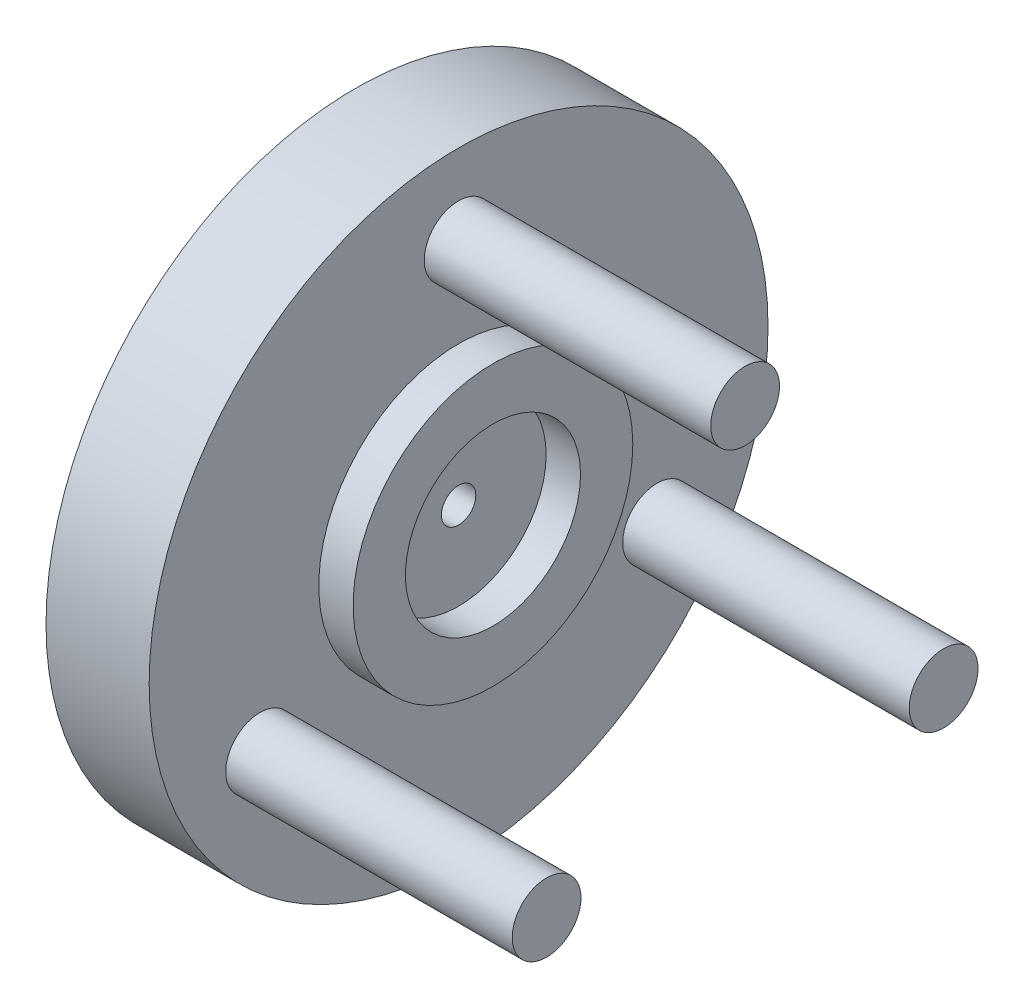
ISO-10303-21;
HEADER;
FILE_DESCRIPTION(('STEP AP214'),'2;1');
FILE_NAME('part.step','',(''),(''),'','','');
FILE_SCHEMA(('AUTOMOTIVE_DESIGN { 1 0 10303 214 1 1 1 1 }'));
ENDSEC;
DATA;
#1=APPLICATION_CONTEXT('core data for automotive mechanical design processes');
#2=APPLICATION_PROTOCOL_DEFINITION('international standard','automotive_design',2000,#1);
#3=PRODUCT_CONTEXT('',#1,'mechanical');
#4=PRODUCT('Part','Part','',(#3));
#5=PRODUCT_RELATED_PRODUCT_CATEGORY('part','',(#4));
#6=PRODUCT_DEFINITION_FORMATION('','',#4);
#7=PRODUCT_DEFINITION_CONTEXT('part definition',#1,'design');
#8=PRODUCT_DEFINITION('design','',#6,#7);
#9=PRODUCT_DEFINITION_SHAPE('','',#8);
#10=(LENGTH_UNIT() NAMED_UNIT(*) SI_UNIT(.MILLI.,.METRE.));
#11=(NAMED_UNIT(*) PLANE_ANGLE_UNIT() SI_UNIT($,.RADIAN.));
#12=(NAMED_UNIT(*) SI_UNIT($,.STERADIAN.) SOLID_ANGLE_UNIT());
#13=UNCERTAINTY_MEASURE_WITH_UNIT(LENGTH_MEASURE(1.E-05),#10,'distance_accuracy_value','');
#14=(GEOMETRIC_REPRESENTATION_CONTEXT(3) GLOBAL_UNCERTAINTY_ASSIGNED_CONTEXT((#13)) GLOBAL_UNIT_ASSIGNED_CONTEXT((#10,
#11,#12)) REPRESENTATION_CONTEXT('',''));
#15=CARTESIAN_POINT('',(0.,0.,0.));
#16=DIRECTION('',(0.,0.,1.));
#17=DIRECTION('',(1.,0.,0.));
#18=AXIS2_PLACEMENT_3D('',#15,#16,#17);
#19=CARTESIAN_POINT('',(9.,0.,0.));
#20=DIRECTION('',(1.,0.,0.));
#21=DIRECTION('',(0.,0.,-1.));
#22=AXIS2_PLACEMENT_3D('',#19,#20,#21);
#23=PLANE('',#22);
#24=CARTESIAN_POINT('',(9.,0.,0.));
#25=DIRECTION('',(1.,0.,0.));
#26=DIRECTION('',(0.,0.,-1.));
#27=AXIS2_PLACEMENT_3D('',#24,#25,#26);
#28=CIRCLE('',#27,1.5);
#29=CARTESIAN_POINT('',(9.,0.,-1.5));
#30=VERTEX_POINT('',#29);
#31=EDGE_CURVE('E61',#30,#30,#28,.T.);
#32=ORIENTED_EDGE('',*,*,#31,.F.);
#33=EDGE_LOOP('',(#32));
#34=FACE_BOUND('',#33,.T.);
#35=CARTESIAN_POINT('',(9.,0.,0.));
#36=DIRECTION('',(1.,0.,0.));
#37=DIRECTION('',(0.,0.,-1.));
#38=AXIS2_PLACEMENT_3D('',#35,#36,#37);
#39=CIRCLE('',#38,7.64);
#40=CARTESIAN_POINT('',(9.,0.,-7.64));
#41=VERTEX_POINT('',#40);
#42=EDGE_CURVE('E10',#41,#41,#39,.F.);
#43=ORIENTED_EDGE('',*,*,#42,.F.);
#44=EDGE_LOOP('',(#43));
#45=FACE_BOUND('',#44,.T.);
#46=ADVANCED_FACE('F41',(#34,#45),#23,.T.);
#47=CARTESIAN_POINT('',(4.,0.,0.));
#48=DIRECTION('',(-1.,0.,0.));
#49=DIRECTION('',(0.,0.,1.));
#50=AXIS2_PLACEMENT_3D('',#47,#48,#49);
#51=CYLINDRICAL_SURFACE('',#50,2.8);
#52=CARTESIAN_POINT('',(4.,0.,0.));
#53=DIRECTION('',(1.,0.,0.));
#54=DIRECTION('',(0.,0.,-1.));
#55=AXIS2_PLACEMENT_3D('',#52,#53,#54);
#56=CIRCLE('',#55,2.8);
#57=CARTESIAN_POINT('',(4.,0.,-2.8));
#58=VERTEX_POINT('',#57);
#59=EDGE_CURVE('E56',#58,#58,#56,.T.);
#60=ORIENTED_EDGE('',*,*,#59,.T.);
#61=EDGE_LOOP('',(#60));
#62=FACE_BOUND('',#61,.T.);
#63=CARTESIAN_POINT('',(0.,0.,0.));
#64=DIRECTION('',(1.,0.,0.));
#65=DIRECTION('',(0.,0.,-1.));
#66=AXIS2_PLACEMENT_3D('',#63,#64,#65);
#67=CIRCLE('',#66,2.8);
#68=CARTESIAN_POINT('',(0.,0.,-2.8));
#69=VERTEX_POINT('',#68);
#70=EDGE_CURVE('E52',#69,#69,#67,.T.);
#71=ORIENTED_EDGE('',*,*,#70,.F.);
#72=EDGE_LOOP('',(#71));
#73=FACE_BOUND('',#72,.T.);
#74=ADVANCED_FACE('F43',(#62,#73),#51,.F.);
#75=CARTESIAN_POINT('',(4.,0.,0.));
#76=DIRECTION('',(-1.,0.,0.));
#77=DIRECTION('',(0.,0.,1.));
#78=AXIS2_PLACEMENT_3D('',#75,#76,#77);
#79=CYLINDRICAL_SURFACE('',#78,27.);
#80=CARTESIAN_POINT('',(0.,0.,0.));
#81=DIRECTION('',(1.,0.,0.));
#82=DIRECTION('',(0.,0.,-1.));
#83=AXIS2_PLACEMENT_3D('',#80,#81,#82);
#84=CIRCLE('',#83,27.);
#85=CARTESIAN_POINT('',(0.,0.,-27.));
#86=VERTEX_POINT('',#85);
#87=EDGE_CURVE('E48',#86,#86,#84,.T.);
#88=ORIENTED_EDGE('',*,*,#87,.T.);
#89=EDGE_LOOP('',(#88));
#90=FACE_BOUND('',#89,.T.);
#91=CARTESIAN_POINT('',(9.,0.,0.));
#92=DIRECTION('',(1.,0.,0.));
#93=DIRECTION('',(0.,0.,-1.));
#94=AXIS2_PLACEMENT_3D('',#91,#92,#93);
#95=CIRCLE('',#94,27.);
#96=CARTESIAN_POINT('',(9.,0.,-27.));
#97=VERTEX_POINT('',#96);
#98=EDGE_CURVE('E65',#97,#97,#95,.T.);
#99=ORIENTED_EDGE('',*,*,#98,.F.);
#100=EDGE_LOOP('',(#99));
#101=FACE_BOUND('',#100,.T.);
#102=ADVANCED_FACE('F124',(#90,#101),#79,.T.);
#103=CARTESIAN_POINT('',(0.,0.,0.));
#104=DIRECTION('',(1.,0.,0.));
#105=DIRECTION('',(0.,0.,-1.));
#106=AXIS2_PLACEMENT_3D('',#103,#104,#105);
#107=PLANE('',#106);
#108=ORIENTED_EDGE('',*,*,#70,.T.);
#109=EDGE_LOOP('',(#108));
#110=FACE_BOUND('',#109,.T.);
#111=ORIENTED_EDGE('',*,*,#87,.F.);
#112=EDGE_LOOP('',(#111));
#113=FACE_BOUND('',#112,.T.);
#114=ADVANCED_FACE('F153',(#110,#113),#107,.F.);
#115=CARTESIAN_POINT('',(4.,0.,0.));
#116=DIRECTION('',(1.,0.,0.));
#117=DIRECTION('',(0.,0.,-1.));
#118=AXIS2_PLACEMENT_3D('',#115,#116,#117);
#119=PLANE('',#118);
#120=CARTESIAN_POINT('',(4.,0.,0.));
#121=DIRECTION('',(1.,0.,0.));
#122=DIRECTION('',(0.,0.,-1.));
#123=AXIS2_PLACEMENT_3D('',#120,#121,#122);
#124=CIRCLE('',#123,1.5);
#125=CARTESIAN_POINT('',(4.,0.,-1.5));
#126=VERTEX_POINT('',#125);
#127=EDGE_CURVE('E62',#126,#126,#124,.T.);
#128=ORIENTED_EDGE('',*,*,#127,.T.);
#129=EDGE_LOOP('',(#128));
#130=FACE_BOUND('',#129,.T.);
#131=ORIENTED_EDGE('',*,*,#59,.F.);
#132=EDGE_LOOP('',(#131));
#133=FACE_BOUND('',#132,.T.);
#134=ADVANCED_FACE('F139',(#130,#133),#119,.F.);
#135=CARTESIAN_POINT('',(9.,0.,0.));
#136=DIRECTION('',(-1.,0.,0.));
#137=DIRECTION('',(0.,0.,1.));
#138=AXIS2_PLACEMENT_3D('',#135,#136,#137);
#139=CYLINDRICAL_SURFACE('',#138,1.5);
#140=ORIENTED_EDGE('',*,*,#31,.T.);
#141=EDGE_LOOP('',(#140));
#142=FACE_BOUND('',#141,.T.);
#143=ORIENTED_EDGE('',*,*,#127,.F.);
#144=EDGE_LOOP('',(#143));
#145=FACE_BOUND('',#144,.T.);
#146=ADVANCED_FACE('F131',(#142,#145),#139,.F.);
#147=CARTESIAN_POINT('',(9.,0.,0.));
#148=DIRECTION('',(1.,0.,0.));
#149=DIRECTION('',(0.,0.,-1.));
#150=AXIS2_PLACEMENT_3D('',#147,#148,#149);
#151=CIRCLE('',#150,12.2);
#152=CARTESIAN_POINT('',(9.,0.,-12.2));
#153=VERTEX_POINT('',#152);
#154=EDGE_CURVE('E89',#153,#153,#151,.T.);
#155=ORIENTED_EDGE('',*,*,#154,.F.);
#156=EDGE_LOOP('',(#155));
#157=FACE_BOUND('',#156,.T.);
#158=CARTESIAN_POINT('',(9.,-9.99999999999984,17.3205080756889));
#159=DIRECTION('',(1.,0.,0.));
#160=DIRECTION('',(0.,0.,-1.));
#161=AXIS2_PLACEMENT_3D('',#158,#159,#160);
#162=CIRCLE('',#161,3.);
#163=CARTESIAN_POINT('',(9.,-9.99999999999984,14.3205080756889));
#164=VERTEX_POINT('',#163);
#165=EDGE_CURVE('E83',#164,#164,#162,.T.);
#166=ORIENTED_EDGE('',*,*,#165,.F.);
#167=EDGE_LOOP('',(#166));
#168=FACE_BOUND('',#167,.T.);
#169=CARTESIAN_POINT('',(9.,-10.0000000000009,-17.32050807569));
#170=DIRECTION('',(1.,0.,0.));
#171=DIRECTION('',(0.,0.,-1.));
#172=AXIS2_PLACEMENT_3D('',#169,#170,#171);
#173=CIRCLE('',#172,2.99999999999948);
#174=CARTESIAN_POINT('',(9.,-10.0000000000009,-20.3205080756894));
#175=VERTEX_POINT('',#174);
#176=EDGE_CURVE('E77',#175,#175,#173,.T.);
#177=ORIENTED_EDGE('',*,*,#176,.F.);
#178=EDGE_LOOP('',(#177));
#179=FACE_BOUND('',#178,.T.);
#180=CARTESIAN_POINT('',(9.,20.0000000000007,-1.46428559612947E-12));
#181=DIRECTION('',(1.,0.,0.));
#182=DIRECTION('',(0.,0.,-1.));
#183=AXIS2_PLACEMENT_3D('',#180,#181,#182);
#184=CIRCLE('',#183,2.99999999999839);
#185=CARTESIAN_POINT('',(9.,20.0000000000007,-2.99999999999985));
#186=VERTEX_POINT('',#185);
#187=EDGE_CURVE('E71',#186,#186,#184,.T.);
#188=ORIENTED_EDGE('',*,*,#187,.F.);
#189=EDGE_LOOP('',(#188));
#190=FACE_BOUND('',#189,.T.);
#191=ORIENTED_EDGE('',*,*,#98,.T.);
#192=EDGE_LOOP('',(#191));
#193=FACE_BOUND('',#192,.T.);
#194=ADVANCED_FACE('F120',(#157,#168,#179,#190,#193),#23,.T.);
#195=CARTESIAN_POINT('',(34.,20.0000000000007,-1.46428559612947E-12));
#196=DIRECTION('',(-1.,0.,0.));
#197=DIRECTION('',(0.,0.,1.));
#198=AXIS2_PLACEMENT_3D('',#195,#196,#197);
#199=CYLINDRICAL_SURFACE('',#198,2.99999999999839);
#200=CARTESIAN_POINT('',(34.,20.0000000000007,-1.46428559612947E-12));
#201=DIRECTION('',(1.,0.,0.));
#202=DIRECTION('',(0.,0.,-1.));
#203=AXIS2_PLACEMENT_3D('',#200,#201,#202);
#204=CIRCLE('',#203,2.99999999999839);
#205=CARTESIAN_POINT('',(34.,20.0000000000007,-2.99999999999985));
#206=VERTEX_POINT('',#205);
#207=EDGE_CURVE('E66',#206,#206,#204,.T.);
#208=ORIENTED_EDGE('',*,*,#207,.F.);
#209=EDGE_LOOP('',(#208));
#210=FACE_BOUND('',#209,.T.);
#211=ORIENTED_EDGE('',*,*,#187,.T.);
#212=EDGE_LOOP('',(#211));
#213=FACE_BOUND('',#212,.T.);
#214=ADVANCED_FACE('F130',(#210,#213),#199,.T.);
#215=CARTESIAN_POINT('',(34.,20.0000000000007,-1.46428559612947E-12));
#216=DIRECTION('',(1.,0.,0.));
#217=DIRECTION('',(0.,0.,-1.));
#218=AXIS2_PLACEMENT_3D('',#215,#216,#217);
#219=PLANE('',#218);
#220=ORIENTED_EDGE('',*,*,#207,.T.);
#221=EDGE_LOOP('',(#220));
#222=FACE_BOUND('',#221,.T.);
#223=ADVANCED_FACE('F136',(#222),#219,.T.);
#224=CARTESIAN_POINT('',(34.,-10.0000000000009,-17.32050807569));
#225=DIRECTION('',(-1.,0.,0.));
#226=DIRECTION('',(0.,0.,1.));
#227=AXIS2_PLACEMENT_3D('',#224,#225,#226);
#228=CYLINDRICAL_SURFACE('',#227,2.99999999999948);
#229=CARTESIAN_POINT('',(34.,-10.0000000000009,-17.32050807569));
#230=DIRECTION('',(1.,0.,0.));
#231=DIRECTION('',(0.,0.,-1.));
#232=AXIS2_PLACEMENT_3D('',#229,#230,#231);
#233=CIRCLE('',#232,2.99999999999948);
#234=CARTESIAN_POINT('',(34.,-10.0000000000009,-20.3205080756894));
#235=VERTEX_POINT('',#234);
#236=EDGE_CURVE('E74',#235,#235,#233,.T.);
#237=ORIENTED_EDGE('',*,*,#236,.F.);
#238=EDGE_LOOP('',(#237));
#239=FACE_BOUND('',#238,.T.);
#240=ORIENTED_EDGE('',*,*,#176,.T.);
#241=EDGE_LOOP('',(#240));
#242=FACE_BOUND('',#241,.T.);
#243=ADVANCED_FACE('F186',(#239,#242),#228,.T.);
#244=CARTESIAN_POINT('',(34.,-10.0000000000009,-17.32050807569));
#245=DIRECTION('',(1.,0.,0.));
#246=DIRECTION('',(0.,0.,-1.));
#247=AXIS2_PLACEMENT_3D('',#244,#245,#246);
#248=PLANE('',#247);
#249=ORIENTED_EDGE('',*,*,#236,.T.);
#250=EDGE_LOOP('',(#249));
#251=FACE_BOUND('',#250,.T.);
#252=ADVANCED_FACE('F194',(#251),#248,.T.);
#253=CARTESIAN_POINT('',(34.,-9.99999999999984,17.3205080756889));
#254=DIRECTION('',(-1.,0.,0.));
#255=DIRECTION('',(0.,0.,1.));
#256=AXIS2_PLACEMENT_3D('',#253,#254,#255);
#257=CYLINDRICAL_SURFACE('',#256,3.);
#258=CARTESIAN_POINT('',(34.,-9.99999999999984,17.3205080756889));
#259=DIRECTION('',(1.,0.,0.));
#260=DIRECTION('',(0.,0.,-1.));
#261=AXIS2_PLACEMENT_3D('',#258,#259,#260);
#262=CIRCLE('',#261,3.);
#263=CARTESIAN_POINT('',(34.,-9.99999999999984,14.3205080756889));
#264=VERTEX_POINT('',#263);
#265=EDGE_CURVE('E80',#264,#264,#262,.T.);
#266=ORIENTED_EDGE('',*,*,#265,.F.);
#267=EDGE_LOOP('',(#266));
#268=FACE_BOUND('',#267,.T.);
#269=ORIENTED_EDGE('',*,*,#165,.T.);
#270=EDGE_LOOP('',(#269));
#271=FACE_BOUND('',#270,.T.);
#272=ADVANCED_FACE('F113',(#268,#271),#257,.T.);
#273=CARTESIAN_POINT('',(34.,-9.99999999999984,17.3205080756889));
#274=DIRECTION('',(1.,0.,0.));
#275=DIRECTION('',(0.,0.,-1.));
#276=AXIS2_PLACEMENT_3D('',#273,#274,#275);
#277=PLANE('',#276);
#278=ORIENTED_EDGE('',*,*,#265,.T.);
#279=EDGE_LOOP('',(#278));
#280=FACE_BOUND('',#279,.T.);
#281=ADVANCED_FACE('F103',(#280),#277,.T.);
#282=CARTESIAN_POINT('',(12.,0.,0.));
#283=DIRECTION('',(1.,0.,0.));
#284=DIRECTION('',(0.,0.,-1.));
#285=AXIS2_PLACEMENT_3D('',#282,#283,#284);
#286=PLANE('',#285);
#287=CARTESIAN_POINT('',(12.,0.,0.));
#288=DIRECTION('',(1.,0.,0.));
#289=DIRECTION('',(0.,0.,-1.));
#290=AXIS2_PLACEMENT_3D('',#287,#288,#289);
#291=CIRCLE('',#290,12.2);
#292=CARTESIAN_POINT('',(12.,0.,-12.2));
#293=VERTEX_POINT('',#292);
#294=EDGE_CURVE('E86',#293,#293,#291,.T.);
#295=ORIENTED_EDGE('',*,*,#294,.T.);
#296=EDGE_LOOP('',(#295));
#297=FACE_BOUND('',#296,.T.);
#298=CARTESIAN_POINT('',(12.,0.,0.));
#299=DIRECTION('',(1.,0.,0.));
#300=DIRECTION('',(0.,0.,-1.));
#301=AXIS2_PLACEMENT_3D('',#298,#299,#300);
#302=CIRCLE('',#301,7.64);
#303=CARTESIAN_POINT('',(12.,0.,-7.64));
#304=VERTEX_POINT('',#303);
#305=EDGE_CURVE('E92',#304,#304,#302,.T.);
#306=ORIENTED_EDGE('',*,*,#305,.F.);
#307=EDGE_LOOP('',(#306));
#308=FACE_BOUND('',#307,.T.);
#309=ADVANCED_FACE('F100',(#297,#308),#286,.T.);
#310=CARTESIAN_POINT('',(12.,0.,0.));
#311=DIRECTION('',(-1.,0.,0.));
#312=DIRECTION('',(0.,0.,1.));
#313=AXIS2_PLACEMENT_3D('',#310,#311,#312);
#314=CYLINDRICAL_SURFACE('',#313,12.2);
#315=ORIENTED_EDGE('',*,*,#294,.F.);
#316=EDGE_LOOP('',(#315));
#317=FACE_BOUND('',#316,.T.);
#318=ORIENTED_EDGE('',*,*,#154,.T.);
#319=EDGE_LOOP('',(#318));
#320=FACE_BOUND('',#319,.T.);
#321=ADVANCED_FACE('F102',(#317,#320),#314,.T.);
#322=CARTESIAN_POINT('',(12.,0.,0.));
#323=DIRECTION('',(-1.,0.,0.));
#324=DIRECTION('',(0.,0.,1.));
#325=AXIS2_PLACEMENT_3D('',#322,#323,#324);
#326=CYLINDRICAL_SURFACE('',#325,7.64);
#327=ORIENTED_EDGE('',*,*,#305,.T.);
#328=EDGE_LOOP('',(#327));
#329=FACE_BOUND('',#328,.T.);
#330=ORIENTED_EDGE('',*,*,#42,.T.);
#331=EDGE_LOOP('',(#330));
#332=FACE_BOUND('',#331,.T.);
#333=ADVANCED_FACE('F98',(#329,#332),#326,.F.);
#334=CLOSED_SHELL('',(#46,#74,#102,#114,#134,#146,#194,#214,#223,#243,#252,#272,#281,#309,#321,#333));
#335=MANIFOLD_SOLID_BREP('B2',#334);
#336=ADVANCED_BREP_SHAPE_REPRESENTATION('',(#18,#335),#14);
#337=SHAPE_DEFINITION_REPRESENTATION(#9,#336);
ENDSEC;
END-ISO-10303-21;
